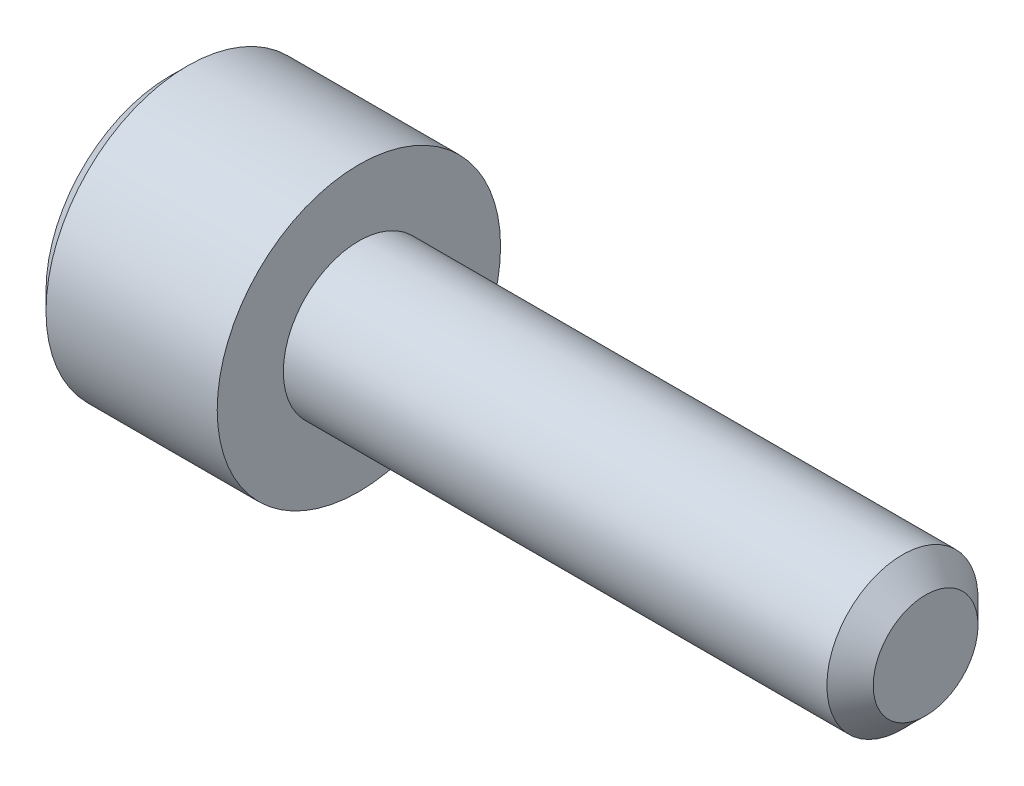
ISO-10303-21;
HEADER;
FILE_DESCRIPTION(('STEP AP214'),'2;1');
FILE_NAME('part.step','',(''),(''),'','','');
FILE_SCHEMA(('AUTOMOTIVE_DESIGN { 1 0 10303 214 1 1 1 1 }'));
ENDSEC;
DATA;
#1=APPLICATION_CONTEXT('core data for automotive mechanical design processes');
#2=APPLICATION_PROTOCOL_DEFINITION('international standard','automotive_design',2000,#1);
#3=PRODUCT_CONTEXT('',#1,'mechanical');
#4=PRODUCT('Part','Part','',(#3));
#5=PRODUCT_RELATED_PRODUCT_CATEGORY('part','',(#4));
#6=PRODUCT_DEFINITION_FORMATION('','',#4);
#7=PRODUCT_DEFINITION_CONTEXT('part definition',#1,'design');
#8=PRODUCT_DEFINITION('design','',#6,#7);
#9=PRODUCT_DEFINITION_SHAPE('','',#8);
#10=(LENGTH_UNIT() NAMED_UNIT(*) SI_UNIT(.MILLI.,.METRE.));
#11=(NAMED_UNIT(*) PLANE_ANGLE_UNIT() SI_UNIT($,.RADIAN.));
#12=(NAMED_UNIT(*) SI_UNIT($,.STERADIAN.) SOLID_ANGLE_UNIT());
#13=UNCERTAINTY_MEASURE_WITH_UNIT(LENGTH_MEASURE(1.E-05),#10,'distance_accuracy_value','');
#14=(GEOMETRIC_REPRESENTATION_CONTEXT(3) GLOBAL_UNCERTAINTY_ASSIGNED_CONTEXT((#13)) GLOBAL_UNIT_ASSIGNED_CONTEXT((#10,
#11,#12)) REPRESENTATION_CONTEXT('',''));
#15=CARTESIAN_POINT('',(0.,0.,0.));
#16=DIRECTION('',(0.,0.,1.));
#17=DIRECTION('',(1.,0.,0.));
#18=AXIS2_PLACEMENT_3D('',#15,#16,#17);
#19=CARTESIAN_POINT('',(-1.85,0.,0.));
#20=DIRECTION('',(-1.,0.,0.));
#21=DIRECTION('',(0.,0.,1.));
#22=AXIS2_PLACEMENT_3D('',#19,#20,#21);
#23=CONICAL_SURFACE('',#22,0.75,0.785398163397448);
#24=CARTESIAN_POINT('',(-2.,0.,0.));
#25=DIRECTION('',(-1.,0.,0.));
#26=DIRECTION('',(0.,0.,1.));
#27=AXIS2_PLACEMENT_3D('',#24,#25,#26);
#28=CIRCLE('',#27,0.9);
#29=CARTESIAN_POINT('',(-2.,0.,0.9));
#30=VERTEX_POINT('',#29);
#31=EDGE_CURVE('E226',#30,#30,#28,.T.);
#32=ORIENTED_EDGE('',*,*,#31,.T.);
#33=EDGE_LOOP('',(#32));
#34=FACE_BOUND('',#33,.T.);
#35=CARTESIAN_POINT('',(-1.96614089692921,0.866140873838278,-0.0002));
#36=CARTESIAN_POINT('',(-1.95125951424836,0.85125103201321,0.0255899625576815));
#37=CARTESIAN_POINT('',(-1.9372516693914,0.83611219228842,0.0518112021286592));
#38=CARTESIAN_POINT('',(-1.9116029284667,0.80524213589435,0.105279708235706));
#39=CARTESIAN_POINT('',(-1.89997631549011,0.789507978959821,0.132532067460573));
#40=CARTESIAN_POINT('',(-1.88005944955668,0.757780686272654,0.187485350381353));
#41=CARTESIAN_POINT('',(-1.87171909786581,0.741795643459148,0.21517225669551));
#42=CARTESIAN_POINT('',(-1.85886814574587,0.709473647943368,0.271155595130853));
#43=CARTESIAN_POINT('',(-1.85434794437328,0.693137683900543,0.299450314843645));
#44=CARTESIAN_POINT('',(-1.85027123688187,0.664986099540475,0.348210289268844));
#45=CARTESIAN_POINT('',(-1.84966820039852,0.653207128451651,0.368612065655573));
#46=CARTESIAN_POINT('',(-1.85067990979997,0.629671982217687,0.40937613469636));
#47=CARTESIAN_POINT('',(-1.85229514477447,0.617915812672248,0.429738417651455));
#48=CARTESIAN_POINT('',(-1.86036155075748,0.582815153286452,0.490534543086824));
#49=CARTESIAN_POINT('',(-1.87003433961216,0.559645329552699,0.530665854996099));
#50=CARTESIAN_POINT('',(-1.89338172175675,0.518974152327359,0.601110400354026));
#51=CARTESIAN_POINT('',(-1.90583396185669,0.501282308923486,0.631753572009086));
#52=CARTESIAN_POINT('',(-1.9338850140153,0.466591771248069,0.69183934580479));
#53=CARTESIAN_POINT('',(-1.94947358968819,0.449591032904757,0.721285488381591));
#54=CARTESIAN_POINT('',(-1.96614089692921,0.432897231838382,0.7502));
#55=B_SPLINE_CURVE_WITH_KNOTS('',3,(#35,#36,#37,#38,#39,#40,#41,#42,#43,#44,#45,#46,#47,#48,#49,
#50,#51,#52,#53,#54),.UNSPECIFIED.,.F.,.F.,(4,2,2,2,2,2,2,2,2,4),(0.,0.0999419466095598,
0.200466857654446,0.299393763705718,0.398071297300231,0.468665775681748,0.53927582139884,
0.680536257244566,0.792918418368074,0.904939568716032),.UNSPECIFIED.);
#56=CARTESIAN_POINT('',(-1.96602540378444,0.86602540378444,0.));
#57=VERTEX_POINT('',#56);
#58=CARTESIAN_POINT('',(-1.96602540378444,0.43301270189222,0.75));
#59=VERTEX_POINT('',#58);
#60=EDGE_CURVE('E54',#57,#59,#55,.T.);
#61=ORIENTED_EDGE('',*,*,#60,.T.);
#62=CARTESIAN_POINT('',(-2.28498450539523,-0.917435707843764,0.75));
#63=CARTESIAN_POINT('',(-2.2678667108574,-0.895322637488462,0.75));
#64=CARTESIAN_POINT('',(-2.25090072767686,-0.873092435797409,0.75));
#65=CARTESIAN_POINT('',(-2.21733662385259,-0.828348331249561,0.75));
#66=CARTESIAN_POINT('',(-2.20073858866413,-0.805834364354332,0.75));
#67=CARTESIAN_POINT('',(-2.15135585709605,-0.737463645985081,0.75));
#68=CARTESIAN_POINT('',(-2.11924462594972,-0.691112526673733,0.75));
#69=CARTESIAN_POINT('',(-2.05568682596992,-0.593551125551393,0.75));
#70=CARTESIAN_POINT('',(-2.02442165720724,-0.542221451270677,0.75));
#71=CARTESIAN_POINT('',(-1.96687568450647,-0.436934399168266,0.75));
#72=CARTESIAN_POINT('',(-1.94057804705966,-0.382986703868344,0.75));
#73=CARTESIAN_POINT('',(-1.90839074036174,-0.302507607984157,0.75));
#74=CARTESIAN_POINT('',(-1.89924982674428,-0.277284063785511,0.75));
#75=CARTESIAN_POINT('',(-1.88298812399052,-0.226180863902708,0.75));
#76=CARTESIAN_POINT('',(-1.87586746044888,-0.20030116753587,0.75));
#77=CARTESIAN_POINT('',(-1.86415365084109,-0.148504398457123,0.75));
#78=CARTESIAN_POINT('',(-1.85951333869583,-0.122598170477208,0.75));
#79=CARTESIAN_POINT('',(-1.85285693649874,-0.070440295072611,0.75));
#80=CARTESIAN_POINT('',(-1.85084110928875,-0.0441886133166744,0.75));
#81=CARTESIAN_POINT('',(-1.84961537614473,0.00715979592785976,0.75));
#82=CARTESIAN_POINT('',(-1.85027949049467,0.0322535332763837,0.75));
#83=CARTESIAN_POINT('',(-1.85408395670594,0.082242672718766,0.75));
#84=CARTESIAN_POINT('',(-1.85722369361662,0.107138122516666,0.75));
#85=CARTESIAN_POINT('',(-1.86585263917875,0.156986366361875,0.75));
#86=CARTESIAN_POINT('',(-1.87138423328569,0.181931702819942,0.75));
#87=CARTESIAN_POINT('',(-1.88448687025693,0.231269085182803,0.75));
#88=CARTESIAN_POINT('',(-1.89205781682589,0.255661157153014,0.75));
#89=CARTESIAN_POINT('',(-1.91810014054592,0.330191673605323,0.75));
#90=CARTESIAN_POINT('',(-1.93943977214851,0.379324631470661,0.75));
#91=CARTESIAN_POINT('',(-1.98693832469846,0.475298904003308,0.75));
#92=CARTESIAN_POINT('',(-2.01311412250561,0.522131443026563,0.75));
#93=CARTESIAN_POINT('',(-2.06717247921482,0.611659319459457,0.75));
#94=CARTESIAN_POINT('',(-2.09490758962535,0.654444829936083,0.75));
#95=CARTESIAN_POINT('',(-2.13780794830858,0.717480249811218,0.75));
#96=CARTESIAN_POINT('',(-2.15226421085697,0.738221190091019,0.75));
#97=CARTESIAN_POINT('',(-2.18156559351443,0.779418304292079,0.75));
#98=CARTESIAN_POINT('',(-2.19641060589534,0.799874554748216,0.75));
#99=CARTESIAN_POINT('',(-2.21141700400184,0.820212019409876,0.75));
#100=B_SPLINE_CURVE_WITH_KNOTS('',3,(#62,#63,#64,#65,#66,#67,#68,#69,#70,#71,#72,#73,#74,#75,
#76,#77,#78,#79,#80,#81,#82,#83,#84,#85,#86,#87,#88,#89,#90,#91,#92,#93,#94,#95,#96,#97,#98,
#99),.UNSPECIFIED.,.F.,.F.,(4,2,2,2,2,2,2,2,2,2,2,2,2,2,2,2,2,2,4),(0.,0.083891166922223,
0.167801617506669,0.336896584417538,0.517070724437731,0.696622901565622,0.77704232374542,
0.857466744334747,0.936301883451218,1.01514491728988,1.09032587205516,1.16548815756962,
1.24204077046884,1.31858976929581,1.47882432997554,1.63962900434597,1.79251782144892,
1.86836026980847,1.94418191901598),.UNSPECIFIED.);
#101=CARTESIAN_POINT('',(-1.96602540378444,-0.43301270189222,0.75));
#102=VERTEX_POINT('',#101);
#103=EDGE_CURVE('E196',#59,#102,#100,.F.);
#104=ORIENTED_EDGE('',*,*,#103,.T.);
#105=CARTESIAN_POINT('',(-1.96614089692921,-0.432897231838382,0.7502));
#106=CARTESIAN_POINT('',(-1.95125951424836,-0.44778707366345,0.724410037442319));
#107=CARTESIAN_POINT('',(-1.9372516693914,-0.462925913388239,0.698188797871341));
#108=CARTESIAN_POINT('',(-1.9116029284667,-0.49379596978231,0.644720291764294));
#109=CARTESIAN_POINT('',(-1.89997631549011,-0.509530126716839,0.617467932539428));
#110=CARTESIAN_POINT('',(-1.88005944955668,-0.541257419404005,0.562514649618648));
#111=CARTESIAN_POINT('',(-1.87171909786581,-0.557242462217511,0.534827743304491));
#112=CARTESIAN_POINT('',(-1.85886814574587,-0.589564457733291,0.478844404869148));
#113=CARTESIAN_POINT('',(-1.85434794437328,-0.605900421776116,0.450549685156356));
#114=CARTESIAN_POINT('',(-1.85027123688187,-0.634052006136184,0.401789710731158));
#115=CARTESIAN_POINT('',(-1.84966820039852,-0.645830977225008,0.381387934344429));
#116=CARTESIAN_POINT('',(-1.85067990979997,-0.669366123458972,0.340623865303642));
#117=CARTESIAN_POINT('',(-1.85229514477447,-0.681122293004411,0.320261582348547));
#118=CARTESIAN_POINT('',(-1.86036155075748,-0.716222952390207,0.259465456913178));
#119=CARTESIAN_POINT('',(-1.87003433961216,-0.73939277612396,0.219334145003903));
#120=CARTESIAN_POINT('',(-1.89338172175675,-0.7800639533493,0.148889599645976));
#121=CARTESIAN_POINT('',(-1.90583396185669,-0.797755796753174,0.118246427990915));
#122=CARTESIAN_POINT('',(-1.9338850140153,-0.83244633442859,0.0581606541952108));
#123=CARTESIAN_POINT('',(-1.94947358968819,-0.849447072771903,0.0287145116184096));
#124=CARTESIAN_POINT('',(-1.96614089692921,-0.866140873838278,-0.000199999999999989));
#125=B_SPLINE_CURVE_WITH_KNOTS('',3,(#105,#106,#107,#108,#109,#110,#111,#112,#113,#114,#115,
#116,#117,#118,#119,#120,#121,#122,#123,#124),.UNSPECIFIED.,.F.,.F.,(4,2,2,2,2,2,2,2,2,4),(0.,
0.0999419466095593,0.200466857654446,0.299393763705716,0.398071297300229,0.468665775681746,
0.539275821398837,0.680536257244564,0.792918418368073,0.904939568716032),.UNSPECIFIED.);
#126=CARTESIAN_POINT('',(-1.96602540378444,-0.86602540378444,0.));
#127=VERTEX_POINT('',#126);
#128=EDGE_CURVE('E140',#102,#127,#125,.T.);
#129=ORIENTED_EDGE('',*,*,#128,.T.);
#130=CARTESIAN_POINT('',(-1.96614089692921,-0.866140873838278,0.0002));
#131=CARTESIAN_POINT('',(-1.95125951424836,-0.85125103201321,-0.0255899625576815));
#132=CARTESIAN_POINT('',(-1.9372516693914,-0.83611219228842,-0.0518112021286592));
#133=CARTESIAN_POINT('',(-1.9116029284667,-0.80524213589435,-0.105279708235706));
#134=CARTESIAN_POINT('',(-1.89997631549011,-0.789507978959821,-0.132532067460573));
#135=CARTESIAN_POINT('',(-1.88005944955668,-0.757780686272654,-0.187485350381353));
#136=CARTESIAN_POINT('',(-1.87171909786581,-0.741795643459148,-0.21517225669551));
#137=CARTESIAN_POINT('',(-1.85886814574587,-0.709473647943368,-0.271155595130853));
#138=CARTESIAN_POINT('',(-1.85434794437328,-0.693137683900543,-0.299450314843645));
#139=CARTESIAN_POINT('',(-1.85027123688187,-0.664986099540475,-0.348210289268844));
#140=CARTESIAN_POINT('',(-1.84966820039852,-0.653207128451651,-0.368612065655573));
#141=CARTESIAN_POINT('',(-1.85067990979997,-0.629671982217687,-0.40937613469636));
#142=CARTESIAN_POINT('',(-1.85229514477447,-0.617915812672248,-0.429738417651455));
#143=CARTESIAN_POINT('',(-1.86036155075748,-0.582815153286452,-0.490534543086824));
#144=CARTESIAN_POINT('',(-1.87003433961216,-0.559645329552699,-0.530665854996099));
#145=CARTESIAN_POINT('',(-1.89338172175675,-0.518974152327359,-0.601110400354026));
#146=CARTESIAN_POINT('',(-1.90583396185669,-0.501282308923486,-0.631753572009086));
#147=CARTESIAN_POINT('',(-1.9338850140153,-0.466591771248069,-0.69183934580479));
#148=CARTESIAN_POINT('',(-1.94947358968819,-0.449591032904757,-0.721285488381591));
#149=CARTESIAN_POINT('',(-1.96614089692921,-0.432897231838382,-0.7502));
#150=B_SPLINE_CURVE_WITH_KNOTS('',3,(#130,#131,#132,#133,#134,#135,#136,#137,#138,#139,#140,
#141,#142,#143,#144,#145,#146,#147,#148,#149),.UNSPECIFIED.,.F.,.F.,(4,2,2,2,2,2,2,2,2,4),(0.,
0.0999419466095598,0.200466857654446,0.299393763705718,0.398071297300231,0.468665775681748,
0.53927582139884,0.680536257244566,0.792918418368074,0.904939568716032),.UNSPECIFIED.);
#151=CARTESIAN_POINT('',(-1.96602540378444,-0.43301270189222,-0.75));
#152=VERTEX_POINT('',#151);
#153=EDGE_CURVE('E187',#127,#152,#150,.T.);
#154=ORIENTED_EDGE('',*,*,#153,.T.);
#155=CARTESIAN_POINT('',(-2.28498450539523,-0.917435707843764,-0.75));
#156=CARTESIAN_POINT('',(-2.2678667108574,-0.895322637488462,-0.75));
#157=CARTESIAN_POINT('',(-2.25090072767686,-0.873092435797409,-0.75));
#158=CARTESIAN_POINT('',(-2.21733662385259,-0.828348331249561,-0.75));
#159=CARTESIAN_POINT('',(-2.20073858866413,-0.805834364354332,-0.75));
#160=CARTESIAN_POINT('',(-2.15135585709605,-0.737463645985081,-0.75));
#161=CARTESIAN_POINT('',(-2.11924462594972,-0.691112526673733,-0.75));
#162=CARTESIAN_POINT('',(-2.05568682596992,-0.593551125551393,-0.75));
#163=CARTESIAN_POINT('',(-2.02442165720724,-0.542221451270677,-0.75));
#164=CARTESIAN_POINT('',(-1.96687568450647,-0.436934399168266,-0.75));
#165=CARTESIAN_POINT('',(-1.94057804705966,-0.382986703868344,-0.75));
#166=CARTESIAN_POINT('',(-1.90839074036174,-0.302507607984157,-0.75));
#167=CARTESIAN_POINT('',(-1.89924982674428,-0.277284063785511,-0.75));
#168=CARTESIAN_POINT('',(-1.88298812399052,-0.226180863902708,-0.75));
#169=CARTESIAN_POINT('',(-1.87586746044888,-0.20030116753587,-0.75));
#170=CARTESIAN_POINT('',(-1.86415365084109,-0.148504398457123,-0.75));
#171=CARTESIAN_POINT('',(-1.85951333869583,-0.122598170477208,-0.75));
#172=CARTESIAN_POINT('',(-1.85285693649874,-0.070440295072611,-0.75));
#173=CARTESIAN_POINT('',(-1.85084110928875,-0.0441886133166744,-0.75));
#174=CARTESIAN_POINT('',(-1.84961537614473,0.00715979592785976,-0.75));
#175=CARTESIAN_POINT('',(-1.85027949049467,0.0322535332763837,-0.75));
#176=CARTESIAN_POINT('',(-1.85408395670594,0.082242672718766,-0.75));
#177=CARTESIAN_POINT('',(-1.85722369361662,0.107138122516666,-0.75));
#178=CARTESIAN_POINT('',(-1.86585263917875,0.156986366361875,-0.75));
#179=CARTESIAN_POINT('',(-1.87138423328569,0.181931702819942,-0.75));
#180=CARTESIAN_POINT('',(-1.88448687025693,0.231269085182803,-0.75));
#181=CARTESIAN_POINT('',(-1.89205781682589,0.255661157153014,-0.75));
#182=CARTESIAN_POINT('',(-1.91810014054592,0.330191673605323,-0.75));
#183=CARTESIAN_POINT('',(-1.93943977214851,0.379324631470661,-0.75));
#184=CARTESIAN_POINT('',(-1.98693832469846,0.475298904003308,-0.75));
#185=CARTESIAN_POINT('',(-2.01311412250561,0.522131443026563,-0.75));
#186=CARTESIAN_POINT('',(-2.06717247921482,0.611659319459457,-0.75));
#187=CARTESIAN_POINT('',(-2.09490758962535,0.654444829936083,-0.75));
#188=CARTESIAN_POINT('',(-2.13780794830858,0.717480249811218,-0.75));
#189=CARTESIAN_POINT('',(-2.15226421085697,0.738221190091019,-0.75));
#190=CARTESIAN_POINT('',(-2.18156559351443,0.779418304292079,-0.75));
#191=CARTESIAN_POINT('',(-2.19641060589534,0.799874554748216,-0.75));
#192=CARTESIAN_POINT('',(-2.21141700400184,0.820212019409876,-0.75));
#193=B_SPLINE_CURVE_WITH_KNOTS('',3,(#155,#156,#157,#158,#159,#160,#161,#162,#163,#164,#165,
#166,#167,#168,#169,#170,#171,#172,#173,#174,#175,#176,#177,#178,#179,#180,#181,#182,#183,#184,
#185,#186,#187,#188,#189,#190,#191,#192),.UNSPECIFIED.,.F.,.F.,(4,2,2,2,2,2,2,2,2,2,2,2,2,2,2,2,
2,2,4),(0.,0.083891166922223,0.167801617506669,0.336896584417538,0.517070724437731,
0.696622901565622,0.77704232374542,0.857466744334747,0.936301883451218,1.01514491728988,
1.09032587205516,1.16548815756962,1.24204077046884,1.31858976929581,1.47882432997554,
1.63962900434597,1.79251782144892,1.86836026980847,1.94418191901598),.UNSPECIFIED.);
#194=CARTESIAN_POINT('',(-1.96602540378444,0.43301270189222,-0.75));
#195=VERTEX_POINT('',#194);
#196=EDGE_CURVE('E182',#152,#195,#193,.T.);
#197=ORIENTED_EDGE('',*,*,#196,.T.);
#198=CARTESIAN_POINT('',(-1.96614089692921,0.432897231838382,-0.7502));
#199=CARTESIAN_POINT('',(-1.95125951424836,0.44778707366345,-0.724410037442319));
#200=CARTESIAN_POINT('',(-1.9372516693914,0.462925913388239,-0.698188797871341));
#201=CARTESIAN_POINT('',(-1.9116029284667,0.49379596978231,-0.644720291764294));
#202=CARTESIAN_POINT('',(-1.89997631549011,0.509530126716839,-0.617467932539428));
#203=CARTESIAN_POINT('',(-1.88005944955668,0.541257419404005,-0.562514649618648));
#204=CARTESIAN_POINT('',(-1.87171909786581,0.557242462217511,-0.534827743304491));
#205=CARTESIAN_POINT('',(-1.85886814574587,0.589564457733291,-0.478844404869148));
#206=CARTESIAN_POINT('',(-1.85434794437328,0.605900421776116,-0.450549685156356));
#207=CARTESIAN_POINT('',(-1.85027123688187,0.634052006136184,-0.401789710731158));
#208=CARTESIAN_POINT('',(-1.84966820039852,0.645830977225008,-0.381387934344429));
#209=CARTESIAN_POINT('',(-1.85067990979997,0.669366123458972,-0.340623865303642));
#210=CARTESIAN_POINT('',(-1.85229514477447,0.681122293004411,-0.320261582348547));
#211=CARTESIAN_POINT('',(-1.86036155075748,0.716222952390207,-0.259465456913178));
#212=CARTESIAN_POINT('',(-1.87003433961216,0.73939277612396,-0.219334145003903));
#213=CARTESIAN_POINT('',(-1.89338172175675,0.7800639533493,-0.148889599645976));
#214=CARTESIAN_POINT('',(-1.90583396185669,0.797755796753174,-0.118246427990915));
#215=CARTESIAN_POINT('',(-1.9338850140153,0.83244633442859,-0.0581606541952108));
#216=CARTESIAN_POINT('',(-1.94947358968819,0.849447072771903,-0.0287145116184096));
#217=CARTESIAN_POINT('',(-1.96614089692921,0.866140873838278,0.000199999999999989));
#218=B_SPLINE_CURVE_WITH_KNOTS('',3,(#198,#199,#200,#201,#202,#203,#204,#205,#206,#207,#208,
#209,#210,#211,#212,#213,#214,#215,#216,#217),.UNSPECIFIED.,.F.,.F.,(4,2,2,2,2,2,2,2,2,4),(0.,
0.0999419466095593,0.200466857654446,0.299393763705716,0.398071297300229,0.468665775681746,
0.539275821398837,0.680536257244564,0.792918418368073,0.904939568716032),.UNSPECIFIED.);
#219=EDGE_CURVE('E143',#195,#57,#218,.T.);
#220=ORIENTED_EDGE('',*,*,#219,.T.);
#221=EDGE_LOOP('',(#61,#104,#129,#154,#197,#220));
#222=FACE_BOUND('',#221,.T.);
#223=ADVANCED_FACE('F39',(#34,#222),#23,.F.);
#224=CARTESIAN_POINT('',(-2.,0.,0.));
#225=DIRECTION('',(1.,0.,0.));
#226=DIRECTION('',(0.,0.,-1.));
#227=AXIS2_PLACEMENT_3D('',#224,#225,#226);
#228=PLANE('',#227);
#229=CARTESIAN_POINT('',(-2.,0.,0.));
#230=DIRECTION('',(-1.,0.,0.));
#231=DIRECTION('',(0.,0.,1.));
#232=AXIS2_PLACEMENT_3D('',#229,#230,#231);
#233=CIRCLE('',#232,1.3125);
#234=CARTESIAN_POINT('',(-2.,0.,1.3125));
#235=VERTEX_POINT('',#234);
#236=EDGE_CURVE('E11',#235,#235,#233,.T.);
#237=ORIENTED_EDGE('',*,*,#236,.T.);
#238=EDGE_LOOP('',(#237));
#239=FACE_BOUND('',#238,.T.);
#240=ORIENTED_EDGE('',*,*,#31,.F.);
#241=EDGE_LOOP('',(#240));
#242=FACE_BOUND('',#241,.T.);
#243=ADVANCED_FACE('F41',(#239,#242),#228,.F.);
#244=CARTESIAN_POINT('',(-1.8125,0.,0.));
#245=DIRECTION('',(1.,0.,0.));
#246=DIRECTION('',(0.,0.,-1.));
#247=AXIS2_PLACEMENT_3D('',#244,#245,#246);
#248=CONICAL_SURFACE('',#247,1.5,0.785398163397448);
#249=ORIENTED_EDGE('',*,*,#236,.F.);
#250=EDGE_LOOP('',(#249));
#251=FACE_BOUND('',#250,.T.);
#252=CARTESIAN_POINT('',(-1.8125,0.,0.));
#253=DIRECTION('',(-1.,0.,0.));
#254=DIRECTION('',(0.,0.,1.));
#255=AXIS2_PLACEMENT_3D('',#252,#253,#254);
#256=CIRCLE('',#255,1.5);
#257=CARTESIAN_POINT('',(-1.8125,0.,1.5));
#258=VERTEX_POINT('',#257);
#259=EDGE_CURVE('E47',#258,#258,#256,.T.);
#260=ORIENTED_EDGE('',*,*,#259,.T.);
#261=EDGE_LOOP('',(#260));
#262=FACE_BOUND('',#261,.T.);
#263=ADVANCED_FACE('F222',(#251,#262),#248,.T.);
#264=CARTESIAN_POINT('',(6.,0.,0.));
#265=DIRECTION('',(-1.,0.,0.));
#266=DIRECTION('',(0.,0.,1.));
#267=AXIS2_PLACEMENT_3D('',#264,#265,#266);
#268=CYLINDRICAL_SURFACE('',#267,1.5);
#269=ORIENTED_EDGE('',*,*,#259,.F.);
#270=EDGE_LOOP('',(#269));
#271=FACE_BOUND('',#270,.T.);
#272=CARTESIAN_POINT('',(0.,0.,0.));
#273=DIRECTION('',(-1.,0.,0.));
#274=DIRECTION('',(0.,0.,1.));
#275=AXIS2_PLACEMENT_3D('',#272,#273,#274);
#276=CIRCLE('',#275,1.5);
#277=CARTESIAN_POINT('',(0.,0.,1.5));
#278=VERTEX_POINT('',#277);
#279=EDGE_CURVE('E241',#278,#278,#276,.T.);
#280=ORIENTED_EDGE('',*,*,#279,.T.);
#281=EDGE_LOOP('',(#280));
#282=FACE_BOUND('',#281,.T.);
#283=ADVANCED_FACE('F247',(#271,#282),#268,.T.);
#284=CARTESIAN_POINT('',(0.,1.5,0.));
#285=DIRECTION('',(-1.,0.,0.));
#286=DIRECTION('',(0.,0.,1.));
#287=AXIS2_PLACEMENT_3D('',#284,#285,#286);
#288=PLANE('',#287);
#289=ORIENTED_EDGE('',*,*,#279,.F.);
#290=EDGE_LOOP('',(#289));
#291=FACE_BOUND('',#290,.T.);
#292=CARTESIAN_POINT('',(0.,0.,0.));
#293=DIRECTION('',(-1.,0.,0.));
#294=DIRECTION('',(0.,0.,1.));
#295=AXIS2_PLACEMENT_3D('',#292,#293,#294);
#296=CIRCLE('',#295,0.8);
#297=CARTESIAN_POINT('',(0.,0.,0.8));
#298=VERTEX_POINT('',#297);
#299=EDGE_CURVE('E238',#298,#298,#296,.T.);
#300=ORIENTED_EDGE('',*,*,#299,.T.);
#301=EDGE_LOOP('',(#300));
#302=FACE_BOUND('',#301,.T.);
#303=ADVANCED_FACE('F250',(#291,#302),#288,.F.);
#304=CARTESIAN_POINT('',(6.,0.,0.));
#305=DIRECTION('',(-1.,0.,0.));
#306=DIRECTION('',(0.,0.,1.));
#307=AXIS2_PLACEMENT_3D('',#304,#305,#306);
#308=CYLINDRICAL_SURFACE('',#307,0.8);
#309=ORIENTED_EDGE('',*,*,#299,.F.);
#310=EDGE_LOOP('',(#309));
#311=FACE_BOUND('',#310,.T.);
#312=CARTESIAN_POINT('',(5.7545,0.,0.));
#313=DIRECTION('',(-1.,0.,0.));
#314=DIRECTION('',(0.,0.,1.));
#315=AXIS2_PLACEMENT_3D('',#312,#313,#314);
#316=CIRCLE('',#315,0.800000000000001);
#317=CARTESIAN_POINT('',(5.7545,0.,0.800000000000001));
#318=VERTEX_POINT('',#317);
#319=EDGE_CURVE('E232',#318,#318,#316,.T.);
#320=ORIENTED_EDGE('',*,*,#319,.T.);
#321=EDGE_LOOP('',(#320));
#322=FACE_BOUND('',#321,.T.);
#323=ADVANCED_FACE('F256',(#311,#322),#308,.T.);
#324=CARTESIAN_POINT('',(6.,0.,0.));
#325=DIRECTION('',(-1.,0.,0.));
#326=DIRECTION('',(0.,0.,1.));
#327=AXIS2_PLACEMENT_3D('',#324,#325,#326);
#328=CONICAL_SURFACE('',#327,0.554500000000001,0.785398163397447);
#329=ORIENTED_EDGE('',*,*,#319,.F.);
#330=EDGE_LOOP('',(#329));
#331=FACE_BOUND('',#330,.T.);
#332=CARTESIAN_POINT('',(6.,0.,0.));
#333=DIRECTION('',(-1.,0.,0.));
#334=DIRECTION('',(0.,0.,1.));
#335=AXIS2_PLACEMENT_3D('',#332,#333,#334);
#336=CIRCLE('',#335,0.554500000000001);
#337=CARTESIAN_POINT('',(6.,0.,0.554500000000001));
#338=VERTEX_POINT('',#337);
#339=EDGE_CURVE('E228',#338,#338,#336,.T.);
#340=ORIENTED_EDGE('',*,*,#339,.T.);
#341=EDGE_LOOP('',(#340));
#342=FACE_BOUND('',#341,.T.);
#343=ADVANCED_FACE('F262',(#331,#342),#328,.T.);
#344=CARTESIAN_POINT('',(6.,0.554500000000001,0.));
#345=DIRECTION('',(-1.,0.,0.));
#346=DIRECTION('',(0.,0.,1.));
#347=AXIS2_PLACEMENT_3D('',#344,#345,#346);
#348=PLANE('',#347);
#349=ORIENTED_EDGE('',*,*,#339,.F.);
#350=EDGE_LOOP('',(#349));
#351=FACE_BOUND('',#350,.T.);
#352=ADVANCED_FACE('F206',(#351),#348,.F.);
#353=CARTESIAN_POINT('',(-1.,0.43301270189222,0.75));
#354=DIRECTION('',(0.,0.,-1.));
#355=DIRECTION('',(-1.,0.,0.));
#356=AXIS2_PLACEMENT_3D('',#353,#354,#355);
#357=PLANE('',#356);
#358=DIRECTION('',(-1.,0.,0.));
#359=VECTOR('',#358,1.);
#360=CARTESIAN_POINT('',(-1.,0.43301270189222,0.75));
#361=LINE('',#360,#359);
#362=CARTESIAN_POINT('',(-1.,0.43301270189222,0.75));
#363=VERTEX_POINT('',#362);
#364=EDGE_CURVE('E426',#363,#59,#361,.T.);
#365=ORIENTED_EDGE('',*,*,#364,.F.);
#366=DIRECTION('',(0.,-1.,0.));
#367=VECTOR('',#366,1.);
#368=CARTESIAN_POINT('',(-1.,0.43301270189222,0.75));
#369=LINE('',#368,#367);
#370=CARTESIAN_POINT('',(-1.,0.,0.75));
#371=VERTEX_POINT('',#370);
#372=EDGE_CURVE('E123',#363,#371,#369,.T.);
#373=ORIENTED_EDGE('',*,*,#372,.T.);
#374=CARTESIAN_POINT('',(-1.,-0.43301270189222,0.75));
#375=VERTEX_POINT('',#374);
#376=EDGE_CURVE('E115',#371,#375,#369,.T.);
#377=ORIENTED_EDGE('',*,*,#376,.T.);
#378=DIRECTION('',(-1.,0.,0.));
#379=VECTOR('',#378,1.);
#380=CARTESIAN_POINT('',(-1.,-0.43301270189222,0.75));
#381=LINE('',#380,#379);
#382=EDGE_CURVE('E121',#375,#102,#381,.T.);
#383=ORIENTED_EDGE('',*,*,#382,.T.);
#384=ORIENTED_EDGE('',*,*,#103,.F.);
#385=EDGE_LOOP('',(#365,#373,#377,#383,#384));
#386=FACE_BOUND('',#385,.T.);
#387=ADVANCED_FACE('F118',(#386),#357,.T.);
#388=CARTESIAN_POINT('',(-1.,-0.43301270189222,0.75));
#389=DIRECTION('',(0.,0.866025403784438,-0.500000000000001));
#390=DIRECTION('',(0.,0.500000000000001,0.866025403784438));
#391=AXIS2_PLACEMENT_3D('',#388,#389,#390);
#392=PLANE('',#391);
#393=ORIENTED_EDGE('',*,*,#382,.F.);
#394=DIRECTION('',(0.,-0.500000000000001,-0.866025403784438));
#395=VECTOR('',#394,1.);
#396=CARTESIAN_POINT('',(-1.,-0.43301270189222,0.75));
#397=LINE('',#396,#395);
#398=CARTESIAN_POINT('',(-1.,-0.64951905283833,0.375000000000001));
#399=VERTEX_POINT('',#398);
#400=EDGE_CURVE('E128',#375,#399,#397,.T.);
#401=ORIENTED_EDGE('',*,*,#400,.T.);
#402=CARTESIAN_POINT('',(-1.,-0.86602540378444,0.));
#403=VERTEX_POINT('',#402);
#404=EDGE_CURVE('E135',#399,#403,#397,.T.);
#405=ORIENTED_EDGE('',*,*,#404,.T.);
#406=DIRECTION('',(-1.,0.,0.));
#407=VECTOR('',#406,1.);
#408=CARTESIAN_POINT('',(-1.,-0.86602540378444,0.));
#409=LINE('',#408,#407);
#410=EDGE_CURVE('E141',#403,#127,#409,.T.);
#411=ORIENTED_EDGE('',*,*,#410,.T.);
#412=ORIENTED_EDGE('',*,*,#128,.F.);
#413=EDGE_LOOP('',(#393,#401,#405,#411,#412));
#414=FACE_BOUND('',#413,.T.);
#415=ADVANCED_FACE('F138',(#414),#392,.T.);
#416=CARTESIAN_POINT('',(-1.,-0.86602540378444,0.));
#417=DIRECTION('',(0.,0.866025403784438,0.500000000000001));
#418=DIRECTION('',(0.,-0.500000000000001,0.866025403784438));
#419=AXIS2_PLACEMENT_3D('',#416,#417,#418);
#420=PLANE('',#419);
#421=ORIENTED_EDGE('',*,*,#410,.F.);
#422=DIRECTION('',(0.,0.500000000000001,-0.866025403784438));
#423=VECTOR('',#422,1.);
#424=CARTESIAN_POINT('',(-1.,-0.86602540378444,0.));
#425=LINE('',#424,#423);
#426=CARTESIAN_POINT('',(-1.,-0.649519052838329,-0.375));
#427=VERTEX_POINT('',#426);
#428=EDGE_CURVE('E62',#403,#427,#425,.T.);
#429=ORIENTED_EDGE('',*,*,#428,.T.);
#430=CARTESIAN_POINT('',(-1.,-0.43301270189222,-0.75));
#431=VERTEX_POINT('',#430);
#432=EDGE_CURVE('E134',#427,#431,#425,.T.);
#433=ORIENTED_EDGE('',*,*,#432,.T.);
#434=DIRECTION('',(-1.,0.,0.));
#435=VECTOR('',#434,1.);
#436=CARTESIAN_POINT('',(-1.,-0.43301270189222,-0.75));
#437=LINE('',#436,#435);
#438=EDGE_CURVE('E145',#431,#152,#437,.T.);
#439=ORIENTED_EDGE('',*,*,#438,.T.);
#440=ORIENTED_EDGE('',*,*,#153,.F.);
#441=EDGE_LOOP('',(#421,#429,#433,#439,#440));
#442=FACE_BOUND('',#441,.T.);
#443=ADVANCED_FACE('F178',(#442),#420,.T.);
#444=CARTESIAN_POINT('',(-1.,-0.43301270189222,-0.75));
#445=DIRECTION('',(0.,0.,1.));
#446=DIRECTION('',(1.,0.,0.));
#447=AXIS2_PLACEMENT_3D('',#444,#445,#446);
#448=PLANE('',#447);
#449=ORIENTED_EDGE('',*,*,#438,.F.);
#450=DIRECTION('',(0.,1.,0.));
#451=VECTOR('',#450,1.);
#452=CARTESIAN_POINT('',(-1.,-0.43301270189222,-0.75));
#453=LINE('',#452,#451);
#454=CARTESIAN_POINT('',(-1.,0.,-0.75));
#455=VERTEX_POINT('',#454);
#456=EDGE_CURVE('E439',#431,#455,#453,.T.);
#457=ORIENTED_EDGE('',*,*,#456,.T.);
#458=CARTESIAN_POINT('',(-1.,0.43301270189222,-0.75));
#459=VERTEX_POINT('',#458);
#460=EDGE_CURVE('E440',#455,#459,#453,.T.);
#461=ORIENTED_EDGE('',*,*,#460,.T.);
#462=DIRECTION('',(-1.,0.,0.));
#463=VECTOR('',#462,1.);
#464=CARTESIAN_POINT('',(-1.,0.43301270189222,-0.75));
#465=LINE('',#464,#463);
#466=EDGE_CURVE('E432',#459,#195,#465,.T.);
#467=ORIENTED_EDGE('',*,*,#466,.T.);
#468=ORIENTED_EDGE('',*,*,#196,.F.);
#469=EDGE_LOOP('',(#449,#457,#461,#467,#468));
#470=FACE_BOUND('',#469,.T.);
#471=ADVANCED_FACE('F173',(#470),#448,.T.);
#472=CARTESIAN_POINT('',(-1.,0.43301270189222,-0.75));
#473=DIRECTION('',(0.,-0.866025403784438,0.500000000000001));
#474=DIRECTION('',(0.,-0.500000000000001,-0.866025403784438));
#475=AXIS2_PLACEMENT_3D('',#472,#473,#474);
#476=PLANE('',#475);
#477=ORIENTED_EDGE('',*,*,#466,.F.);
#478=DIRECTION('',(0.,0.500000000000001,0.866025403784438));
#479=VECTOR('',#478,1.);
#480=CARTESIAN_POINT('',(-1.,0.43301270189222,-0.75));
#481=LINE('',#480,#479);
#482=CARTESIAN_POINT('',(-1.,0.64951905283833,-0.375000000000001));
#483=VERTEX_POINT('',#482);
#484=EDGE_CURVE('E421',#459,#483,#481,.T.);
#485=ORIENTED_EDGE('',*,*,#484,.T.);
#486=CARTESIAN_POINT('',(-1.,0.86602540378444,0.));
#487=VERTEX_POINT('',#486);
#488=EDGE_CURVE('E418',#483,#487,#481,.T.);
#489=ORIENTED_EDGE('',*,*,#488,.T.);
#490=DIRECTION('',(-1.,0.,0.));
#491=VECTOR('',#490,1.);
#492=CARTESIAN_POINT('',(-1.,0.86602540378444,0.));
#493=LINE('',#492,#491);
#494=EDGE_CURVE('E425',#487,#57,#493,.T.);
#495=ORIENTED_EDGE('',*,*,#494,.T.);
#496=ORIENTED_EDGE('',*,*,#219,.F.);
#497=EDGE_LOOP('',(#477,#485,#489,#495,#496));
#498=FACE_BOUND('',#497,.T.);
#499=ADVANCED_FACE('F167',(#498),#476,.T.);
#500=CARTESIAN_POINT('',(-1.,0.86602540378444,0.));
#501=DIRECTION('',(0.,-0.866025403784438,-0.500000000000001));
#502=DIRECTION('',(0.,0.500000000000001,-0.866025403784438));
#503=AXIS2_PLACEMENT_3D('',#500,#501,#502);
#504=PLANE('',#503);
#505=ORIENTED_EDGE('',*,*,#494,.F.);
#506=DIRECTION('',(0.,-0.500000000000001,0.866025403784438));
#507=VECTOR('',#506,1.);
#508=CARTESIAN_POINT('',(-1.,0.86602540378444,0.));
#509=LINE('',#508,#507);
#510=CARTESIAN_POINT('',(-1.,0.64951905283833,0.375000000000001));
#511=VERTEX_POINT('',#510);
#512=EDGE_CURVE('E417',#487,#511,#509,.T.);
#513=ORIENTED_EDGE('',*,*,#512,.T.);
#514=EDGE_CURVE('E420',#511,#363,#509,.T.);
#515=ORIENTED_EDGE('',*,*,#514,.T.);
#516=ORIENTED_EDGE('',*,*,#364,.T.);
#517=ORIENTED_EDGE('',*,*,#60,.F.);
#518=EDGE_LOOP('',(#505,#513,#515,#516,#517));
#519=FACE_BOUND('',#518,.T.);
#520=ADVANCED_FACE('F162',(#519),#504,.T.);
#521=CARTESIAN_POINT('',(-1.,0.,0.));
#522=DIRECTION('',(1.,0.,0.));
#523=DIRECTION('',(0.,0.,-1.));
#524=AXIS2_PLACEMENT_3D('',#521,#522,#523);
#525=PLANE('',#524);
#526=CARTESIAN_POINT('',(-1.,0.,0.));
#527=DIRECTION('',(-1.,0.,0.));
#528=DIRECTION('',(0.,0.,1.));
#529=AXIS2_PLACEMENT_3D('',#526,#527,#528);
#530=CIRCLE('',#529,0.75);
#531=EDGE_CURVE('E410',#483,#455,#530,.T.);
#532=ORIENTED_EDGE('',*,*,#531,.F.);
#533=ORIENTED_EDGE('',*,*,#484,.F.);
#534=ORIENTED_EDGE('',*,*,#460,.F.);
#535=EDGE_LOOP('',(#532,#533,#534));
#536=FACE_BOUND('',#535,.T.);
#537=ADVANCED_FACE('F166',(#536),#525,.F.);
#538=EDGE_CURVE('E234',#511,#483,#530,.T.);
#539=ORIENTED_EDGE('',*,*,#538,.F.);
#540=ORIENTED_EDGE('',*,*,#512,.F.);
#541=ORIENTED_EDGE('',*,*,#488,.F.);
#542=EDGE_LOOP('',(#539,#540,#541));
#543=FACE_BOUND('',#542,.T.);
#544=ADVANCED_FACE('F359',(#543),#525,.F.);
#545=EDGE_CURVE('E229',#371,#511,#530,.T.);
#546=ORIENTED_EDGE('',*,*,#545,.F.);
#547=ORIENTED_EDGE('',*,*,#372,.F.);
#548=ORIENTED_EDGE('',*,*,#514,.F.);
#549=EDGE_LOOP('',(#546,#547,#548));
#550=FACE_BOUND('',#549,.T.);
#551=ADVANCED_FACE('F368',(#550),#525,.F.);
#552=EDGE_CURVE('E130',#399,#371,#530,.T.);
#553=ORIENTED_EDGE('',*,*,#552,.F.);
#554=ORIENTED_EDGE('',*,*,#400,.F.);
#555=ORIENTED_EDGE('',*,*,#376,.F.);
#556=EDGE_LOOP('',(#553,#554,#555));
#557=FACE_BOUND('',#556,.T.);
#558=ADVANCED_FACE('F129',(#557),#525,.F.);
#559=EDGE_CURVE('E405',#427,#399,#530,.T.);
#560=ORIENTED_EDGE('',*,*,#559,.F.);
#561=ORIENTED_EDGE('',*,*,#428,.F.);
#562=ORIENTED_EDGE('',*,*,#404,.F.);
#563=EDGE_LOOP('',(#560,#561,#562));
#564=FACE_BOUND('',#563,.T.);
#565=ADVANCED_FACE('F213',(#564),#525,.F.);
#566=EDGE_CURVE('E407',#455,#427,#530,.T.);
#567=ORIENTED_EDGE('',*,*,#566,.F.);
#568=ORIENTED_EDGE('',*,*,#456,.F.);
#569=ORIENTED_EDGE('',*,*,#432,.F.);
#570=EDGE_LOOP('',(#567,#568,#569));
#571=FACE_BOUND('',#570,.T.);
#572=ADVANCED_FACE('F169',(#571),#525,.F.);
#573=CARTESIAN_POINT('',(-0.6,0.,0.));
#574=DIRECTION('',(-1.,0.,0.));
#575=DIRECTION('',(0.,0.,1.));
#576=AXIS2_PLACEMENT_3D('',#573,#574,#575);
#577=CONICAL_SURFACE('',#576,0.,1.08083900054117);
#578=ORIENTED_EDGE('',*,*,#545,.T.);
#579=ORIENTED_EDGE('',*,*,#538,.T.);
#580=ORIENTED_EDGE('',*,*,#531,.T.);
#581=ORIENTED_EDGE('',*,*,#566,.T.);
#582=ORIENTED_EDGE('',*,*,#559,.T.);
#583=ORIENTED_EDGE('',*,*,#552,.T.);
#584=EDGE_LOOP('',(#578,#579,#580,#581,#582,#583));
#585=FACE_BOUND('',#584,.T.);
#586=CARTESIAN_POINT('',(-0.6,0.,0.));
#587=VERTEX_POINT('',#586);
#588=VERTEX_LOOP('',#587);
#589=FACE_BOUND('',#588,.T.);
#590=ADVANCED_FACE('F207',(#585,#589),#577,.F.);
#591=CLOSED_SHELL('',(#223,#243,#263,#283,#303,#323,#343,#352,#387,#415,#443,#471,#499,#520,
#537,#544,#551,#558,#565,#572,#590));
#592=MANIFOLD_SOLID_BREP('B2',#591);
#593=ADVANCED_BREP_SHAPE_REPRESENTATION('',(#18,#592),#14);
#594=SHAPE_DEFINITION_REPRESENTATION(#9,#593);
ENDSEC;
END-ISO-10303-21;
